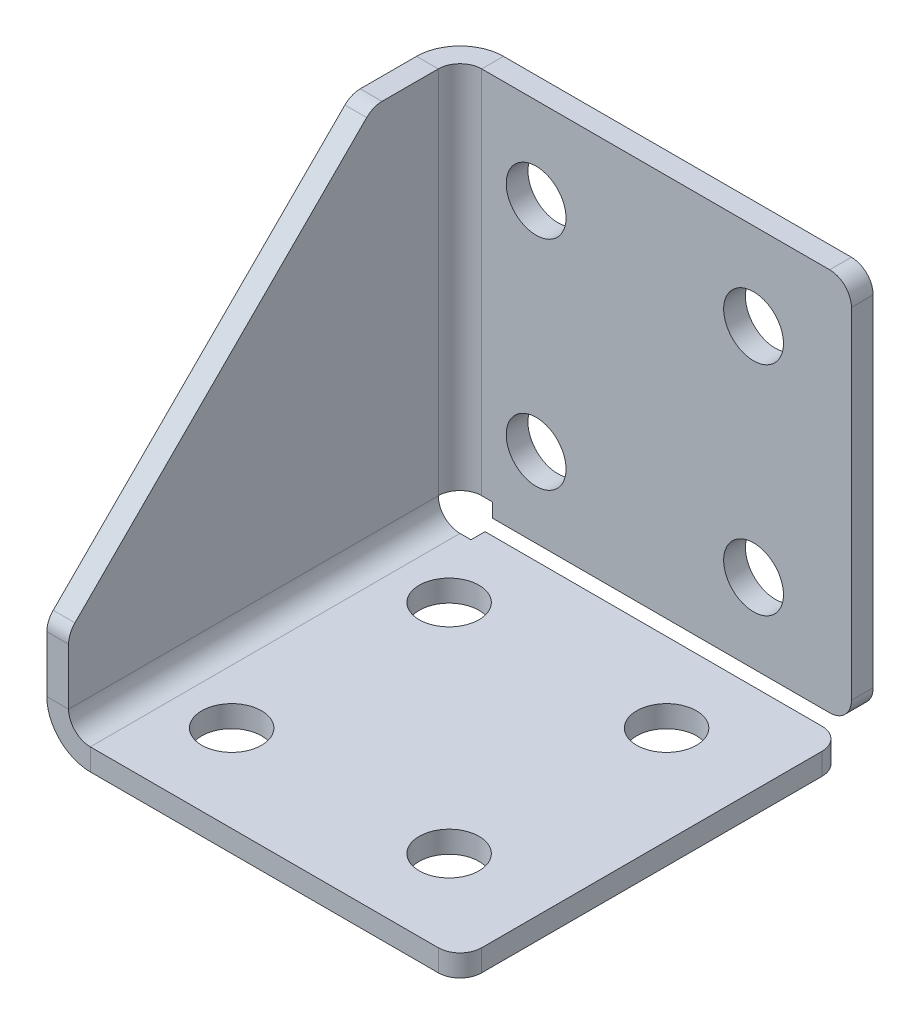
ISO-10303-21;
HEADER;
FILE_DESCRIPTION(('STEP AP214'),'2;1');
FILE_NAME('part.step','',(''),(''),'','','');
FILE_SCHEMA(('AUTOMOTIVE_DESIGN { 1 0 10303 214 1 1 1 1 }'));
ENDSEC;
DATA;
#1=APPLICATION_CONTEXT('core data for automotive mechanical design processes');
#2=APPLICATION_PROTOCOL_DEFINITION('international standard','automotive_design',2000,#1);
#3=PRODUCT_CONTEXT('',#1,'mechanical');
#4=PRODUCT('Part','Part','',(#3));
#5=PRODUCT_RELATED_PRODUCT_CATEGORY('part','',(#4));
#6=PRODUCT_DEFINITION_FORMATION('','',#4);
#7=PRODUCT_DEFINITION_CONTEXT('part definition',#1,'design');
#8=PRODUCT_DEFINITION('design','',#6,#7);
#9=PRODUCT_DEFINITION_SHAPE('','',#8);
#10=(LENGTH_UNIT() NAMED_UNIT(*) SI_UNIT(.MILLI.,.METRE.));
#11=(NAMED_UNIT(*) PLANE_ANGLE_UNIT() SI_UNIT($,.RADIAN.));
#12=(NAMED_UNIT(*) SI_UNIT($,.STERADIAN.) SOLID_ANGLE_UNIT());
#13=UNCERTAINTY_MEASURE_WITH_UNIT(LENGTH_MEASURE(1.E-05),#10,'distance_accuracy_value','');
#14=(GEOMETRIC_REPRESENTATION_CONTEXT(3) GLOBAL_UNCERTAINTY_ASSIGNED_CONTEXT((#13)) GLOBAL_UNIT_ASSIGNED_CONTEXT((#10,
#11,#12)) REPRESENTATION_CONTEXT('',''));
#15=CARTESIAN_POINT('',(0.,0.,0.));
#16=DIRECTION('',(0.,0.,1.));
#17=DIRECTION('',(1.,0.,0.));
#18=AXIS2_PLACEMENT_3D('',#15,#16,#17);
#19=CARTESIAN_POINT('',(-19.,2.,38.));
#20=DIRECTION('',(0.,-1.,0.));
#21=DIRECTION('',(0.,0.,-1.));
#22=AXIS2_PLACEMENT_3D('',#19,#20,#21);
#23=PLANE('',#22);
#24=CARTESIAN_POINT('',(-10.,2.,10.));
#25=DIRECTION('',(0.,1.,0.));
#26=DIRECTION('',(0.,0.,1.));
#27=AXIS2_PLACEMENT_3D('',#24,#25,#26);
#28=CIRCLE('',#27,2.74999999999999);
#29=CARTESIAN_POINT('',(-10.,2.,12.75));
#30=VERTEX_POINT('',#29);
#31=EDGE_CURVE('E645',#30,#30,#28,.T.);
#32=ORIENTED_EDGE('',*,*,#31,.F.);
#33=EDGE_LOOP('',(#32));
#34=FACE_BOUND('',#33,.T.);
#35=CARTESIAN_POINT('',(10.,2.,30.));
#36=DIRECTION('',(0.,1.,0.));
#37=DIRECTION('',(0.,0.,1.));
#38=AXIS2_PLACEMENT_3D('',#35,#36,#37);
#39=CIRCLE('',#38,2.74999999999999);
#40=CARTESIAN_POINT('',(10.,2.,32.75));
#41=VERTEX_POINT('',#40);
#42=EDGE_CURVE('E637',#41,#41,#39,.T.);
#43=ORIENTED_EDGE('',*,*,#42,.F.);
#44=EDGE_LOOP('',(#43));
#45=FACE_BOUND('',#44,.T.);
#46=CARTESIAN_POINT('',(10.,2.,10.));
#47=DIRECTION('',(0.,1.,0.));
#48=DIRECTION('',(0.,0.,1.));
#49=AXIS2_PLACEMENT_3D('',#46,#47,#48);
#50=CIRCLE('',#49,2.74999999999999);
#51=CARTESIAN_POINT('',(10.,2.,12.75));
#52=VERTEX_POINT('',#51);
#53=EDGE_CURVE('E621',#52,#52,#50,.T.);
#54=ORIENTED_EDGE('',*,*,#53,.F.);
#55=EDGE_LOOP('',(#54));
#56=FACE_BOUND('',#55,.T.);
#57=DIRECTION('',(0.,0.,-1.));
#58=VECTOR('',#57,1.);
#59=CARTESIAN_POINT('',(19.,2.,38.));
#60=LINE('',#59,#58);
#61=CARTESIAN_POINT('',(19.,2.,36.));
#62=VERTEX_POINT('',#61);
#63=CARTESIAN_POINT('',(19.,2.,4.70710678118655));
#64=VERTEX_POINT('',#63);
#65=EDGE_CURVE('E349',#62,#64,#60,.T.);
#66=ORIENTED_EDGE('',*,*,#65,.T.);
#67=CARTESIAN_POINT('',(17.,2.,4.70710678118655));
#68=DIRECTION('',(0.,-1.,0.));
#69=DIRECTION('',(0.,0.,-1.));
#70=AXIS2_PLACEMENT_3D('',#67,#68,#69);
#71=CIRCLE('',#70,2.);
#72=CARTESIAN_POINT('',(17.,2.,2.70710678118655));
#73=VERTEX_POINT('',#72);
#74=EDGE_CURVE('E440',#64,#73,#71,.F.);
#75=ORIENTED_EDGE('',*,*,#74,.T.);
#76=DIRECTION('',(1.,0.,0.));
#77=VECTOR('',#76,1.);
#78=CARTESIAN_POINT('',(-19.,2.,2.70710678118655));
#79=LINE('',#78,#77);
#80=CARTESIAN_POINT('',(-13.989599,2.,2.70710678118655));
#81=VERTEX_POINT('',#80);
#82=EDGE_CURVE('E317',#81,#73,#79,.T.);
#83=ORIENTED_EDGE('',*,*,#82,.F.);
#84=DIRECTION('',(0.,0.,-1.));
#85=VECTOR('',#84,1.);
#86=CARTESIAN_POINT('',(-13.989599,2.,38.));
#87=LINE('',#86,#85);
#88=CARTESIAN_POINT('',(-13.989599,2.,3.99999999999997));
#89=VERTEX_POINT('',#88);
#90=EDGE_CURVE('E209',#89,#81,#87,.T.);
#91=ORIENTED_EDGE('',*,*,#90,.F.);
#92=DIRECTION('',(1.,0.,0.));
#93=VECTOR('',#92,1.);
#94=CARTESIAN_POINT('',(-19.,2.,3.99999999999997));
#95=LINE('',#94,#93);
#96=CARTESIAN_POINT('',(-15.,2.,3.99999999999997));
#97=VERTEX_POINT('',#96);
#98=EDGE_CURVE('E313',#89,#97,#95,.F.);
#99=ORIENTED_EDGE('',*,*,#98,.T.);
#100=DIRECTION('',(0.,0.,-1.));
#101=VECTOR('',#100,1.);
#102=CARTESIAN_POINT('',(-15.,2.,38.));
#103=LINE('',#102,#101);
#104=CARTESIAN_POINT('',(-15.,2.,38.));
#105=VERTEX_POINT('',#104);
#106=EDGE_CURVE('E299',#105,#97,#103,.T.);
#107=ORIENTED_EDGE('',*,*,#106,.F.);
#108=DIRECTION('',(1.,0.,0.));
#109=VECTOR('',#108,1.);
#110=CARTESIAN_POINT('',(-19.,2.,38.));
#111=LINE('',#110,#109);
#112=CARTESIAN_POINT('',(17.,2.,38.));
#113=VERTEX_POINT('',#112);
#114=EDGE_CURVE('E341',#105,#113,#111,.T.);
#115=ORIENTED_EDGE('',*,*,#114,.T.);
#116=CARTESIAN_POINT('',(17.,2.,36.));
#117=DIRECTION('',(0.,-1.,0.));
#118=DIRECTION('',(0.,0.,-1.));
#119=AXIS2_PLACEMENT_3D('',#116,#117,#118);
#120=CIRCLE('',#119,2.);
#121=EDGE_CURVE('E437',#113,#62,#120,.F.);
#122=ORIENTED_EDGE('',*,*,#121,.T.);
#123=EDGE_LOOP('',(#66,#75,#83,#91,#99,#107,#115,#122));
#124=FACE_BOUND('',#123,.T.);
#125=CARTESIAN_POINT('',(-10.,2.,30.));
#126=DIRECTION('',(0.,1.,0.));
#127=DIRECTION('',(0.,0.,1.));
#128=AXIS2_PLACEMENT_3D('',#125,#126,#127);
#129=CIRCLE('',#128,2.74999999999999);
#130=CARTESIAN_POINT('',(-10.,2.,32.75));
#131=VERTEX_POINT('',#130);
#132=EDGE_CURVE('E629',#131,#131,#129,.T.);
#133=ORIENTED_EDGE('',*,*,#132,.F.);
#134=EDGE_LOOP('',(#133));
#135=FACE_BOUND('',#134,.T.);
#136=ADVANCED_FACE('F46',(#34,#45,#56,#124,#135),#23,.F.);
#137=CARTESIAN_POINT('',(-19.,0.,2.));
#138=DIRECTION('',(0.,0.,-1.));
#139=DIRECTION('',(-1.,0.,0.));
#140=AXIS2_PLACEMENT_3D('',#137,#138,#139);
#141=PLANE('',#140);
#142=CARTESIAN_POINT('',(-10.,10.,2.));
#143=DIRECTION('',(0.,0.,1.));
#144=DIRECTION('',(1.,0.,0.));
#145=AXIS2_PLACEMENT_3D('',#142,#143,#144);
#146=CIRCLE('',#145,2.75);
#147=CARTESIAN_POINT('',(-7.25,10.,2.));
#148=VERTEX_POINT('',#147);
#149=EDGE_CURVE('E613',#148,#148,#146,.T.);
#150=ORIENTED_EDGE('',*,*,#149,.F.);
#151=EDGE_LOOP('',(#150));
#152=FACE_BOUND('',#151,.T.);
#153=CARTESIAN_POINT('',(10.,30.,2.));
#154=DIRECTION('',(0.,0.,1.));
#155=DIRECTION('',(1.,0.,0.));
#156=AXIS2_PLACEMENT_3D('',#153,#154,#155);
#157=CIRCLE('',#156,2.75);
#158=CARTESIAN_POINT('',(12.75,30.,2.));
#159=VERTEX_POINT('',#158);
#160=EDGE_CURVE('E605',#159,#159,#157,.T.);
#161=ORIENTED_EDGE('',*,*,#160,.F.);
#162=EDGE_LOOP('',(#161));
#163=FACE_BOUND('',#162,.T.);
#164=CARTESIAN_POINT('',(10.,10.,2.));
#165=DIRECTION('',(0.,0.,1.));
#166=DIRECTION('',(1.,0.,0.));
#167=AXIS2_PLACEMENT_3D('',#164,#165,#166);
#168=CIRCLE('',#167,2.75);
#169=CARTESIAN_POINT('',(12.75,10.,2.));
#170=VERTEX_POINT('',#169);
#171=EDGE_CURVE('E589',#170,#170,#168,.T.);
#172=ORIENTED_EDGE('',*,*,#171,.F.);
#173=EDGE_LOOP('',(#172));
#174=FACE_BOUND('',#173,.T.);
#175=DIRECTION('',(0.,1.,0.));
#176=VECTOR('',#175,1.);
#177=CARTESIAN_POINT('',(19.,0.,2.));
#178=LINE('',#177,#176);
#179=CARTESIAN_POINT('',(19.,4.70710678118655,2.));
#180=VERTEX_POINT('',#179);
#181=CARTESIAN_POINT('',(19.,36.,2.));
#182=VERTEX_POINT('',#181);
#183=EDGE_CURVE('E318',#180,#182,#178,.T.);
#184=ORIENTED_EDGE('',*,*,#183,.T.);
#185=CARTESIAN_POINT('',(17.,36.,2.));
#186=DIRECTION('',(0.,0.,-1.));
#187=DIRECTION('',(-1.,0.,0.));
#188=AXIS2_PLACEMENT_3D('',#185,#186,#187);
#189=CIRCLE('',#188,2.);
#190=CARTESIAN_POINT('',(17.,38.,2.));
#191=VERTEX_POINT('',#190);
#192=EDGE_CURVE('E416',#182,#191,#189,.F.);
#193=ORIENTED_EDGE('',*,*,#192,.T.);
#194=DIRECTION('',(-1.,0.,0.));
#195=VECTOR('',#194,1.);
#196=CARTESIAN_POINT('',(-19.,38.,2.));
#197=LINE('',#196,#195);
#198=CARTESIAN_POINT('',(-15.,38.,2.));
#199=VERTEX_POINT('',#198);
#200=EDGE_CURVE('E322',#199,#191,#197,.F.);
#201=ORIENTED_EDGE('',*,*,#200,.F.);
#202=DIRECTION('',(0.,1.,0.));
#203=VECTOR('',#202,1.);
#204=CARTESIAN_POINT('',(-15.,0.,2.));
#205=LINE('',#204,#203);
#206=CARTESIAN_POINT('',(-15.,3.99999999999997,2.));
#207=VERTEX_POINT('',#206);
#208=EDGE_CURVE('E290',#207,#199,#205,.T.);
#209=ORIENTED_EDGE('',*,*,#208,.F.);
#210=DIRECTION('',(-1.,0.,0.));
#211=VECTOR('',#210,1.);
#212=CARTESIAN_POINT('',(-19.,3.99999999999997,2.));
#213=LINE('',#212,#211);
#214=CARTESIAN_POINT('',(-13.989599,3.99999999999997,2.));
#215=VERTEX_POINT('',#214);
#216=EDGE_CURVE('E295',#207,#215,#213,.F.);
#217=ORIENTED_EDGE('',*,*,#216,.T.);
#218=DIRECTION('',(0.,1.,0.));
#219=VECTOR('',#218,1.);
#220=CARTESIAN_POINT('',(-13.989599,0.,2.));
#221=LINE('',#220,#219);
#222=CARTESIAN_POINT('',(-13.989599,2.70710678118655,2.));
#223=VERTEX_POINT('',#222);
#224=EDGE_CURVE('E309',#223,#215,#221,.T.);
#225=ORIENTED_EDGE('',*,*,#224,.F.);
#226=DIRECTION('',(-1.,0.,0.));
#227=VECTOR('',#226,1.);
#228=CARTESIAN_POINT('',(-19.,2.70710678118655,2.));
#229=LINE('',#228,#227);
#230=CARTESIAN_POINT('',(17.,2.70710678118655,2.));
#231=VERTEX_POINT('',#230);
#232=EDGE_CURVE('E314',#231,#223,#229,.T.);
#233=ORIENTED_EDGE('',*,*,#232,.F.);
#234=CARTESIAN_POINT('',(17.,4.70710678118655,2.));
#235=DIRECTION('',(0.,0.,-1.));
#236=DIRECTION('',(-1.,0.,0.));
#237=AXIS2_PLACEMENT_3D('',#234,#235,#236);
#238=CIRCLE('',#237,2.);
#239=EDGE_CURVE('E413',#231,#180,#238,.F.);
#240=ORIENTED_EDGE('',*,*,#239,.T.);
#241=EDGE_LOOP('',(#184,#193,#201,#209,#217,#225,#233,#240));
#242=FACE_BOUND('',#241,.T.);
#243=CARTESIAN_POINT('',(-10.,30.,2.));
#244=DIRECTION('',(0.,0.,1.));
#245=DIRECTION('',(1.,0.,0.));
#246=AXIS2_PLACEMENT_3D('',#243,#244,#245);
#247=CIRCLE('',#246,2.75);
#248=CARTESIAN_POINT('',(-7.25,30.,2.));
#249=VERTEX_POINT('',#248);
#250=EDGE_CURVE('E597',#249,#249,#247,.T.);
#251=ORIENTED_EDGE('',*,*,#250,.F.);
#252=EDGE_LOOP('',(#251));
#253=FACE_BOUND('',#252,.T.);
#254=ADVANCED_FACE('F520',(#152,#163,#174,#242,#253),#141,.F.);
#255=CARTESIAN_POINT('',(-15.,4.,3.99999999999997));
#256=DIRECTION('',(0.,0.,-1.));
#257=DIRECTION('',(-1.,0.,0.));
#258=AXIS2_PLACEMENT_3D('',#255,#256,#257);
#259=PLANE('',#258);
#260=DIRECTION('',(-1.,0.,0.));
#261=VECTOR('',#260,1.);
#262=CARTESIAN_POINT('',(-19.,3.99999999999997,3.99999999999997));
#263=LINE('',#262,#261);
#264=CARTESIAN_POINT('',(-17.,3.99999999999997,3.99999999999999));
#265=VERTEX_POINT('',#264);
#266=CARTESIAN_POINT('',(-19.,3.99999999999997,3.99999999999997));
#267=VERTEX_POINT('',#266);
#268=EDGE_CURVE('E391',#265,#267,#263,.T.);
#269=ORIENTED_EDGE('',*,*,#268,.F.);
#270=CARTESIAN_POINT('',(-15.,4.,3.99999999999997));
#271=DIRECTION('',(0.,0.,1.));
#272=DIRECTION('',(1.,0.,0.));
#273=AXIS2_PLACEMENT_3D('',#270,#271,#272);
#274=CIRCLE('',#273,2.);
#275=EDGE_CURVE('E345',#265,#97,#274,.T.);
#276=ORIENTED_EDGE('',*,*,#275,.T.);
#277=DIRECTION('',(0.,-1.,0.));
#278=VECTOR('',#277,1.);
#279=CARTESIAN_POINT('',(-15.,0.,3.99999999999997));
#280=LINE('',#279,#278);
#281=CARTESIAN_POINT('',(-15.,0.,3.99999999999997));
#282=VERTEX_POINT('',#281);
#283=EDGE_CURVE('E388',#97,#282,#280,.T.);
#284=ORIENTED_EDGE('',*,*,#283,.T.);
#285=CARTESIAN_POINT('',(-15.,4.,3.99999999999997));
#286=DIRECTION('',(0.,0.,1.));
#287=DIRECTION('',(1.,0.,0.));
#288=AXIS2_PLACEMENT_3D('',#285,#286,#287);
#289=CIRCLE('',#288,4.);
#290=EDGE_CURVE('E282',#267,#282,#289,.T.);
#291=ORIENTED_EDGE('',*,*,#290,.F.);
#292=EDGE_LOOP('',(#269,#276,#284,#291));
#293=FACE_BOUND('',#292,.T.);
#294=ADVANCED_FACE('F547',(#293),#259,.T.);
#295=CARTESIAN_POINT('',(-19.,0.,3.99999999999997));
#296=DIRECTION('',(0.,0.,1.));
#297=DIRECTION('',(-1.,0.,0.));
#298=AXIS2_PLACEMENT_3D('',#295,#296,#297);
#299=PLANE('',#298);
#300=ORIENTED_EDGE('',*,*,#283,.F.);
#301=ORIENTED_EDGE('',*,*,#98,.F.);
#302=DIRECTION('',(0.,-1.,0.));
#303=VECTOR('',#302,1.);
#304=CARTESIAN_POINT('',(-13.989599,0.,3.99999999999997));
#305=LINE('',#304,#303);
#306=CARTESIAN_POINT('',(-13.989599,0.,3.99999999999997));
#307=VERTEX_POINT('',#306);
#308=EDGE_CURVE('E215',#89,#307,#305,.T.);
#309=ORIENTED_EDGE('',*,*,#308,.T.);
#310=DIRECTION('',(-1.,0.,0.));
#311=VECTOR('',#310,1.);
#312=CARTESIAN_POINT('',(-19.,0.,3.99999999999997));
#313=LINE('',#312,#311);
#314=EDGE_CURVE('E225',#307,#282,#313,.T.);
#315=ORIENTED_EDGE('',*,*,#314,.T.);
#316=EDGE_LOOP('',(#300,#301,#309,#315));
#317=FACE_BOUND('',#316,.T.);
#318=ADVANCED_FACE('F732',(#317),#299,.F.);
#319=CARTESIAN_POINT('',(-13.989599,0.,38.));
#320=DIRECTION('',(-1.,0.,0.));
#321=DIRECTION('',(0.,0.,-1.));
#322=AXIS2_PLACEMENT_3D('',#319,#320,#321);
#323=PLANE('',#322);
#324=ORIENTED_EDGE('',*,*,#308,.F.);
#325=ORIENTED_EDGE('',*,*,#90,.T.);
#326=DIRECTION('',(0.,-1.,0.));
#327=VECTOR('',#326,1.);
#328=CARTESIAN_POINT('',(-13.989599,0.,2.70710678118655));
#329=LINE('',#328,#327);
#330=CARTESIAN_POINT('',(-13.989599,0.,2.70710678118655));
#331=VERTEX_POINT('',#330);
#332=EDGE_CURVE('E204',#81,#331,#329,.T.);
#333=ORIENTED_EDGE('',*,*,#332,.T.);
#334=DIRECTION('',(0.,0.,-1.));
#335=VECTOR('',#334,1.);
#336=CARTESIAN_POINT('',(-13.989599,0.,38.));
#337=LINE('',#336,#335);
#338=EDGE_CURVE('E207',#307,#331,#337,.T.);
#339=ORIENTED_EDGE('',*,*,#338,.F.);
#340=EDGE_LOOP('',(#324,#325,#333,#339));
#341=FACE_BOUND('',#340,.T.);
#342=ADVANCED_FACE('F206',(#341),#323,.T.);
#343=CARTESIAN_POINT('',(-19.,0.,2.70710678118655));
#344=DIRECTION('',(0.,0.,-1.));
#345=DIRECTION('',(1.,0.,0.));
#346=AXIS2_PLACEMENT_3D('',#343,#344,#345);
#347=PLANE('',#346);
#348=ORIENTED_EDGE('',*,*,#82,.T.);
#349=DIRECTION('',(0.,1.,0.));
#350=VECTOR('',#349,1.);
#351=CARTESIAN_POINT('',(17.,0.,2.70710678118655));
#352=LINE('',#351,#350);
#353=CARTESIAN_POINT('',(17.,0.,2.70710678118655));
#354=VERTEX_POINT('',#353);
#355=EDGE_CURVE('E232',#73,#354,#352,.F.);
#356=ORIENTED_EDGE('',*,*,#355,.T.);
#357=DIRECTION('',(1.,0.,0.));
#358=VECTOR('',#357,1.);
#359=CARTESIAN_POINT('',(-19.,0.,2.70710678118655));
#360=LINE('',#359,#358);
#361=EDGE_CURVE('E222',#331,#354,#360,.T.);
#362=ORIENTED_EDGE('',*,*,#361,.F.);
#363=ORIENTED_EDGE('',*,*,#332,.F.);
#364=EDGE_LOOP('',(#348,#356,#362,#363));
#365=FACE_BOUND('',#364,.T.);
#366=ADVANCED_FACE('F230',(#365),#347,.T.);
#367=CARTESIAN_POINT('',(19.,0.,38.));
#368=DIRECTION('',(-1.,0.,0.));
#369=DIRECTION('',(0.,0.,-1.));
#370=AXIS2_PLACEMENT_3D('',#367,#368,#369);
#371=PLANE('',#370);
#372=DIRECTION('',(0.,0.,-1.));
#373=VECTOR('',#372,1.);
#374=CARTESIAN_POINT('',(19.,0.,38.));
#375=LINE('',#374,#373);
#376=CARTESIAN_POINT('',(19.,0.,36.));
#377=VERTEX_POINT('',#376);
#378=CARTESIAN_POINT('',(19.,0.,4.70710678118655));
#379=VERTEX_POINT('',#378);
#380=EDGE_CURVE('E274',#377,#379,#375,.T.);
#381=ORIENTED_EDGE('',*,*,#380,.T.);
#382=DIRECTION('',(0.,-1.,0.));
#383=VECTOR('',#382,1.);
#384=CARTESIAN_POINT('',(19.,0.,4.70710678118655));
#385=LINE('',#384,#383);
#386=EDGE_CURVE('E434',#379,#64,#385,.F.);
#387=ORIENTED_EDGE('',*,*,#386,.T.);
#388=ORIENTED_EDGE('',*,*,#65,.F.);
#389=DIRECTION('',(0.,1.,0.));
#390=VECTOR('',#389,1.);
#391=CARTESIAN_POINT('',(19.,0.,36.));
#392=LINE('',#391,#390);
#393=EDGE_CURVE('E430',#62,#377,#392,.F.);
#394=ORIENTED_EDGE('',*,*,#393,.T.);
#395=EDGE_LOOP('',(#381,#387,#388,#394));
#396=FACE_BOUND('',#395,.T.);
#397=ADVANCED_FACE('F578',(#396),#371,.F.);
#398=CARTESIAN_POINT('',(-19.,0.,38.));
#399=DIRECTION('',(0.,0.,-1.));
#400=DIRECTION('',(1.,0.,0.));
#401=AXIS2_PLACEMENT_3D('',#398,#399,#400);
#402=PLANE('',#401);
#403=DIRECTION('',(1.,0.,0.));
#404=VECTOR('',#403,1.);
#405=CARTESIAN_POINT('',(-19.,0.,38.));
#406=LINE('',#405,#404);
#407=CARTESIAN_POINT('',(-15.,0.,38.));
#408=VERTEX_POINT('',#407);
#409=CARTESIAN_POINT('',(17.,0.,38.));
#410=VERTEX_POINT('',#409);
#411=EDGE_CURVE('E494',#408,#410,#406,.T.);
#412=ORIENTED_EDGE('',*,*,#411,.T.);
#413=DIRECTION('',(0.,1.,0.));
#414=VECTOR('',#413,1.);
#415=CARTESIAN_POINT('',(17.,0.,38.));
#416=LINE('',#415,#414);
#417=EDGE_CURVE('E443',#410,#113,#416,.T.);
#418=ORIENTED_EDGE('',*,*,#417,.T.);
#419=ORIENTED_EDGE('',*,*,#114,.F.);
#420=DIRECTION('',(0.,-1.,0.));
#421=VECTOR('',#420,1.);
#422=CARTESIAN_POINT('',(-15.,0.,38.));
#423=LINE('',#422,#421);
#424=EDGE_CURVE('E216',#105,#408,#423,.T.);
#425=ORIENTED_EDGE('',*,*,#424,.T.);
#426=EDGE_LOOP('',(#412,#418,#419,#425));
#427=FACE_BOUND('',#426,.T.);
#428=ADVANCED_FACE('F565',(#427),#402,.F.);
#429=CARTESIAN_POINT('',(-15.,4.,38.));
#430=DIRECTION('',(0.,0.,-1.));
#431=DIRECTION('',(-1.,0.,0.));
#432=AXIS2_PLACEMENT_3D('',#429,#430,#431);
#433=PLANE('',#432);
#434=ORIENTED_EDGE('',*,*,#424,.F.);
#435=CARTESIAN_POINT('',(-15.,4.,38.));
#436=DIRECTION('',(0.,0.,1.));
#437=DIRECTION('',(1.,0.,0.));
#438=AXIS2_PLACEMENT_3D('',#435,#436,#437);
#439=CIRCLE('',#438,2.);
#440=CARTESIAN_POINT('',(-17.,4.,38.));
#441=VERTEX_POINT('',#440);
#442=EDGE_CURVE('E332',#105,#441,#439,.F.);
#443=ORIENTED_EDGE('',*,*,#442,.T.);
#444=DIRECTION('',(-1.,0.,0.));
#445=VECTOR('',#444,1.);
#446=CARTESIAN_POINT('',(-19.,4.,38.));
#447=LINE('',#446,#445);
#448=CARTESIAN_POINT('',(-19.,4.,38.));
#449=VERTEX_POINT('',#448);
#450=EDGE_CURVE('E380',#441,#449,#447,.T.);
#451=ORIENTED_EDGE('',*,*,#450,.T.);
#452=CARTESIAN_POINT('',(-15.,4.,38.));
#453=DIRECTION('',(0.,0.,1.));
#454=DIRECTION('',(1.,0.,0.));
#455=AXIS2_PLACEMENT_3D('',#452,#453,#454);
#456=CIRCLE('',#455,4.);
#457=EDGE_CURVE('E270',#408,#449,#456,.F.);
#458=ORIENTED_EDGE('',*,*,#457,.F.);
#459=EDGE_LOOP('',(#434,#443,#451,#458));
#460=FACE_BOUND('',#459,.T.);
#461=ADVANCED_FACE('F556',(#460),#433,.F.);
#462=CARTESIAN_POINT('',(-19.,10.,38.));
#463=DIRECTION('',(0.,0.,1.));
#464=DIRECTION('',(0.,-1.,0.));
#465=AXIS2_PLACEMENT_3D('',#462,#463,#464);
#466=PLANE('',#465);
#467=DIRECTION('',(0.,1.,0.));
#468=VECTOR('',#467,1.);
#469=CARTESIAN_POINT('',(-17.,0.,38.));
#470=LINE('',#469,#468);
#471=CARTESIAN_POINT('',(-17.,9.17157287525381,38.));
#472=VERTEX_POINT('',#471);
#473=EDGE_CURVE('E338',#472,#441,#470,.F.);
#474=ORIENTED_EDGE('',*,*,#473,.F.);
#475=DIRECTION('',(-1.,0.,0.));
#476=VECTOR('',#475,1.);
#477=CARTESIAN_POINT('',(-19.,9.17157287525381,38.));
#478=LINE('',#477,#476);
#479=CARTESIAN_POINT('',(-19.,9.17157287525381,38.));
#480=VERTEX_POINT('',#479);
#481=EDGE_CURVE('E446',#472,#480,#478,.T.);
#482=ORIENTED_EDGE('',*,*,#481,.T.);
#483=DIRECTION('',(0.,-1.,0.));
#484=VECTOR('',#483,1.);
#485=CARTESIAN_POINT('',(-19.,10.,38.));
#486=LINE('',#485,#484);
#487=EDGE_CURVE('E483',#480,#449,#486,.T.);
#488=ORIENTED_EDGE('',*,*,#487,.T.);
#489=ORIENTED_EDGE('',*,*,#450,.F.);
#490=EDGE_LOOP('',(#474,#482,#488,#489));
#491=FACE_BOUND('',#490,.T.);
#492=ADVANCED_FACE('F476',(#491),#466,.T.);
#493=CARTESIAN_POINT('',(-19.,38.,10.));
#494=DIRECTION('',(0.,0.707106781186548,0.707106781186548));
#495=DIRECTION('',(0.,-0.707106781186547,0.707106781186547));
#496=AXIS2_PLACEMENT_3D('',#493,#494,#495);
#497=PLANE('',#496);
#498=DIRECTION('',(0.,-0.707106781186547,0.707106781186547));
#499=VECTOR('',#498,1.);
#500=CARTESIAN_POINT('',(-19.,38.,10.));
#501=LINE('',#500,#499);
#502=CARTESIAN_POINT('',(-19.,37.4142135623731,10.5857864376269));
#503=VERTEX_POINT('',#502);
#504=CARTESIAN_POINT('',(-19.,10.5857864376269,37.4142135623731));
#505=VERTEX_POINT('',#504);
#506=EDGE_CURVE('E482',#503,#505,#501,.T.);
#507=ORIENTED_EDGE('',*,*,#506,.T.);
#508=DIRECTION('',(-1.,0.,0.));
#509=VECTOR('',#508,1.);
#510=CARTESIAN_POINT('',(-19.,10.5857864376269,37.4142135623731));
#511=LINE('',#510,#509);
#512=CARTESIAN_POINT('',(-17.,10.5857864376269,37.4142135623731));
#513=VERTEX_POINT('',#512);
#514=EDGE_CURVE('E68',#505,#513,#511,.F.);
#515=ORIENTED_EDGE('',*,*,#514,.T.);
#516=DIRECTION('',(0.,-0.707106781186547,0.707106781186547));
#517=VECTOR('',#516,1.);
#518=CARTESIAN_POINT('',(-17.,38.,10.));
#519=LINE('',#518,#517);
#520=CARTESIAN_POINT('',(-17.,37.4142135623731,10.5857864376269));
#521=VERTEX_POINT('',#520);
#522=EDGE_CURVE('E335',#521,#513,#519,.T.);
#523=ORIENTED_EDGE('',*,*,#522,.F.);
#524=DIRECTION('',(-1.,0.,0.));
#525=VECTOR('',#524,1.);
#526=CARTESIAN_POINT('',(-19.,37.4142135623731,10.5857864376269));
#527=LINE('',#526,#525);
#528=EDGE_CURVE('E456',#521,#503,#527,.T.);
#529=ORIENTED_EDGE('',*,*,#528,.T.);
#530=EDGE_LOOP('',(#507,#515,#523,#529));
#531=FACE_BOUND('',#530,.T.);
#532=ADVANCED_FACE('F484',(#531),#497,.T.);
#533=CARTESIAN_POINT('',(-19.,38.,0.));
#534=DIRECTION('',(0.,1.,0.));
#535=DIRECTION('',(0.,0.,1.));
#536=AXIS2_PLACEMENT_3D('',#533,#534,#535);
#537=PLANE('',#536);
#538=DIRECTION('',(0.,0.,1.));
#539=VECTOR('',#538,1.);
#540=CARTESIAN_POINT('',(-19.,38.,0.));
#541=LINE('',#540,#539);
#542=CARTESIAN_POINT('',(-19.,38.,4.));
#543=VERTEX_POINT('',#542);
#544=CARTESIAN_POINT('',(-19.,38.,9.17157287525381));
#545=VERTEX_POINT('',#544);
#546=EDGE_CURVE('E487',#543,#545,#541,.T.);
#547=ORIENTED_EDGE('',*,*,#546,.T.);
#548=DIRECTION('',(-1.,0.,0.));
#549=VECTOR('',#548,1.);
#550=CARTESIAN_POINT('',(-19.,38.,9.17157287525381));
#551=LINE('',#550,#549);
#552=CARTESIAN_POINT('',(-17.,38.,9.17157287525381));
#553=VERTEX_POINT('',#552);
#554=EDGE_CURVE('E11',#545,#553,#551,.F.);
#555=ORIENTED_EDGE('',*,*,#554,.T.);
#556=DIRECTION('',(0.,0.,-1.));
#557=VECTOR('',#556,1.);
#558=CARTESIAN_POINT('',(-17.,38.,0.));
#559=LINE('',#558,#557);
#560=CARTESIAN_POINT('',(-17.,38.,4.));
#561=VERTEX_POINT('',#560);
#562=EDGE_CURVE('E326',#561,#553,#559,.F.);
#563=ORIENTED_EDGE('',*,*,#562,.F.);
#564=DIRECTION('',(-1.,0.,0.));
#565=VECTOR('',#564,1.);
#566=CARTESIAN_POINT('',(-19.,38.,4.));
#567=LINE('',#566,#565);
#568=EDGE_CURVE('E377',#561,#543,#567,.T.);
#569=ORIENTED_EDGE('',*,*,#568,.T.);
#570=EDGE_LOOP('',(#547,#555,#563,#569));
#571=FACE_BOUND('',#570,.T.);
#572=ADVANCED_FACE('F714',(#571),#537,.T.);
#573=CARTESIAN_POINT('',(-15.,38.,4.));
#574=DIRECTION('',(0.,1.,0.));
#575=DIRECTION('',(0.,0.,1.));
#576=AXIS2_PLACEMENT_3D('',#573,#574,#575);
#577=PLANE('',#576);
#578=ORIENTED_EDGE('',*,*,#568,.F.);
#579=CARTESIAN_POINT('',(-15.,38.,4.));
#580=DIRECTION('',(0.,-1.,0.));
#581=DIRECTION('',(0.,0.,-1.));
#582=AXIS2_PLACEMENT_3D('',#579,#580,#581);
#583=CIRCLE('',#582,2.);
#584=EDGE_CURVE('E327',#561,#199,#583,.T.);
#585=ORIENTED_EDGE('',*,*,#584,.T.);
#586=DIRECTION('',(0.,0.,-1.));
#587=VECTOR('',#586,1.);
#588=CARTESIAN_POINT('',(-15.,38.,0.));
#589=LINE('',#588,#587);
#590=CARTESIAN_POINT('',(-15.,38.,0.));
#591=VERTEX_POINT('',#590);
#592=EDGE_CURVE('E374',#199,#591,#589,.T.);
#593=ORIENTED_EDGE('',*,*,#592,.T.);
#594=CARTESIAN_POINT('',(-15.,38.,4.));
#595=DIRECTION('',(0.,-1.,0.));
#596=DIRECTION('',(0.,0.,-1.));
#597=AXIS2_PLACEMENT_3D('',#594,#595,#596);
#598=CIRCLE('',#597,4.);
#599=EDGE_CURVE('E265',#543,#591,#598,.T.);
#600=ORIENTED_EDGE('',*,*,#599,.F.);
#601=EDGE_LOOP('',(#578,#585,#593,#600));
#602=FACE_BOUND('',#601,.T.);
#603=ADVANCED_FACE('F711',(#602),#577,.T.);
#604=CARTESIAN_POINT('',(-19.,38.,0.));
#605=DIRECTION('',(0.,1.,0.));
#606=DIRECTION('',(1.,0.,0.));
#607=AXIS2_PLACEMENT_3D('',#604,#605,#606);
#608=PLANE('',#607);
#609=ORIENTED_EDGE('',*,*,#200,.T.);
#610=DIRECTION('',(0.,0.,1.));
#611=VECTOR('',#610,1.);
#612=CARTESIAN_POINT('',(17.,38.,0.));
#613=LINE('',#612,#611);
#614=CARTESIAN_POINT('',(17.,38.,0.));
#615=VERTEX_POINT('',#614);
#616=EDGE_CURVE('E394',#191,#615,#613,.F.);
#617=ORIENTED_EDGE('',*,*,#616,.T.);
#618=DIRECTION('',(1.,0.,0.));
#619=VECTOR('',#618,1.);
#620=CARTESIAN_POINT('',(-19.,38.,0.));
#621=LINE('',#620,#619);
#622=EDGE_CURVE('E242',#591,#615,#621,.T.);
#623=ORIENTED_EDGE('',*,*,#622,.F.);
#624=ORIENTED_EDGE('',*,*,#592,.F.);
#625=EDGE_LOOP('',(#609,#617,#623,#624));
#626=FACE_BOUND('',#625,.T.);
#627=ADVANCED_FACE('F508',(#626),#608,.T.);
#628=CARTESIAN_POINT('',(19.,0.,0.));
#629=DIRECTION('',(-1.,0.,0.));
#630=DIRECTION('',(0.,1.,0.));
#631=AXIS2_PLACEMENT_3D('',#628,#629,#630);
#632=PLANE('',#631);
#633=DIRECTION('',(0.,1.,0.));
#634=VECTOR('',#633,1.);
#635=CARTESIAN_POINT('',(19.,0.,0.));
#636=LINE('',#635,#634);
#637=CARTESIAN_POINT('',(19.,4.70710678118655,0.));
#638=VERTEX_POINT('',#637);
#639=CARTESIAN_POINT('',(19.,36.,0.));
#640=VERTEX_POINT('',#639);
#641=EDGE_CURVE('E234',#638,#640,#636,.T.);
#642=ORIENTED_EDGE('',*,*,#641,.T.);
#643=DIRECTION('',(0.,0.,-1.));
#644=VECTOR('',#643,1.);
#645=CARTESIAN_POINT('',(19.,36.,0.));
#646=LINE('',#645,#644);
#647=EDGE_CURVE('E410',#640,#182,#646,.F.);
#648=ORIENTED_EDGE('',*,*,#647,.T.);
#649=ORIENTED_EDGE('',*,*,#183,.F.);
#650=DIRECTION('',(0.,0.,-1.));
#651=VECTOR('',#650,1.);
#652=CARTESIAN_POINT('',(19.,4.70710678118655,0.));
#653=LINE('',#652,#651);
#654=EDGE_CURVE('E406',#180,#638,#653,.T.);
#655=ORIENTED_EDGE('',*,*,#654,.T.);
#656=EDGE_LOOP('',(#642,#648,#649,#655));
#657=FACE_BOUND('',#656,.T.);
#658=ADVANCED_FACE('F517',(#657),#632,.F.);
#659=CARTESIAN_POINT('',(-19.,2.70710678118655,0.));
#660=DIRECTION('',(0.,-1.,0.));
#661=DIRECTION('',(-1.,0.,0.));
#662=AXIS2_PLACEMENT_3D('',#659,#660,#661);
#663=PLANE('',#662);
#664=DIRECTION('',(-1.,0.,0.));
#665=VECTOR('',#664,1.);
#666=CARTESIAN_POINT('',(-19.,2.70710678118655,0.));
#667=LINE('',#666,#665);
#668=CARTESIAN_POINT('',(17.,2.70710678118655,0.));
#669=VERTEX_POINT('',#668);
#670=CARTESIAN_POINT('',(-13.989599,2.70710678118655,0.));
#671=VERTEX_POINT('',#670);
#672=EDGE_CURVE('E227',#669,#671,#667,.T.);
#673=ORIENTED_EDGE('',*,*,#672,.F.);
#674=DIRECTION('',(0.,0.,1.));
#675=VECTOR('',#674,1.);
#676=CARTESIAN_POINT('',(17.,2.70710678118655,0.));
#677=LINE('',#676,#675);
#678=EDGE_CURVE('E419',#669,#231,#677,.T.);
#679=ORIENTED_EDGE('',*,*,#678,.T.);
#680=ORIENTED_EDGE('',*,*,#232,.T.);
#681=DIRECTION('',(0.,0.,-1.));
#682=VECTOR('',#681,1.);
#683=CARTESIAN_POINT('',(-13.989599,2.70710678118655,0.));
#684=LINE('',#683,#682);
#685=EDGE_CURVE('E370',#223,#671,#684,.T.);
#686=ORIENTED_EDGE('',*,*,#685,.T.);
#687=EDGE_LOOP('',(#673,#679,#680,#686));
#688=FACE_BOUND('',#687,.T.);
#689=ADVANCED_FACE('F530',(#688),#663,.T.);
#690=CARTESIAN_POINT('',(-13.989599,0.,0.));
#691=DIRECTION('',(-1.,0.,0.));
#692=DIRECTION('',(0.,1.,0.));
#693=AXIS2_PLACEMENT_3D('',#690,#691,#692);
#694=PLANE('',#693);
#695=ORIENTED_EDGE('',*,*,#685,.F.);
#696=ORIENTED_EDGE('',*,*,#224,.T.);
#697=DIRECTION('',(0.,0.,-1.));
#698=VECTOR('',#697,1.);
#699=CARTESIAN_POINT('',(-13.989599,3.99999999999997,0.));
#700=LINE('',#699,#698);
#701=CARTESIAN_POINT('',(-13.989599,3.99999999999997,0.));
#702=VERTEX_POINT('',#701);
#703=EDGE_CURVE('E367',#215,#702,#700,.T.);
#704=ORIENTED_EDGE('',*,*,#703,.T.);
#705=DIRECTION('',(0.,1.,0.));
#706=VECTOR('',#705,1.);
#707=CARTESIAN_POINT('',(-13.989599,0.,0.));
#708=LINE('',#707,#706);
#709=EDGE_CURVE('E248',#671,#702,#708,.T.);
#710=ORIENTED_EDGE('',*,*,#709,.F.);
#711=EDGE_LOOP('',(#695,#696,#704,#710));
#712=FACE_BOUND('',#711,.T.);
#713=ADVANCED_FACE('F534',(#712),#694,.T.);
#714=CARTESIAN_POINT('',(-19.,3.99999999999997,0.));
#715=DIRECTION('',(0.,1.,0.));
#716=DIRECTION('',(1.,0.,0.));
#717=AXIS2_PLACEMENT_3D('',#714,#715,#716);
#718=PLANE('',#717);
#719=ORIENTED_EDGE('',*,*,#703,.F.);
#720=ORIENTED_EDGE('',*,*,#216,.F.);
#721=DIRECTION('',(0.,0.,-1.));
#722=VECTOR('',#721,1.);
#723=CARTESIAN_POINT('',(-15.,3.99999999999997,0.));
#724=LINE('',#723,#722);
#725=CARTESIAN_POINT('',(-15.,3.99999999999997,0.));
#726=VERTEX_POINT('',#725);
#727=EDGE_CURVE('E281',#207,#726,#724,.T.);
#728=ORIENTED_EDGE('',*,*,#727,.T.);
#729=DIRECTION('',(1.,0.,0.));
#730=VECTOR('',#729,1.);
#731=CARTESIAN_POINT('',(-19.,3.99999999999997,0.));
#732=LINE('',#731,#730);
#733=EDGE_CURVE('E252',#726,#702,#732,.T.);
#734=ORIENTED_EDGE('',*,*,#733,.T.);
#735=EDGE_LOOP('',(#719,#720,#728,#734));
#736=FACE_BOUND('',#735,.T.);
#737=ADVANCED_FACE('F536',(#736),#718,.F.);
#738=CARTESIAN_POINT('',(-15.,3.99999999999997,4.));
#739=DIRECTION('',(0.,-1.,0.));
#740=DIRECTION('',(0.,0.,-1.));
#741=AXIS2_PLACEMENT_3D('',#738,#739,#740);
#742=PLANE('',#741);
#743=CARTESIAN_POINT('',(-15.,3.99999999999997,4.));
#744=DIRECTION('',(0.,-1.,0.));
#745=DIRECTION('',(0.,0.,-1.));
#746=AXIS2_PLACEMENT_3D('',#743,#744,#745);
#747=CIRCLE('',#746,2.);
#748=EDGE_CURVE('E331',#207,#265,#747,.F.);
#749=ORIENTED_EDGE('',*,*,#748,.T.);
#750=ORIENTED_EDGE('',*,*,#268,.T.);
#751=CARTESIAN_POINT('',(-15.,3.99999999999997,4.));
#752=DIRECTION('',(0.,1.,0.));
#753=DIRECTION('',(0.,0.,1.));
#754=AXIS2_PLACEMENT_3D('',#751,#752,#753);
#755=CIRCLE('',#754,4.);
#756=EDGE_CURVE('E269',#726,#267,#755,.T.);
#757=ORIENTED_EDGE('',*,*,#756,.F.);
#758=ORIENTED_EDGE('',*,*,#727,.F.);
#759=EDGE_LOOP('',(#749,#750,#757,#758));
#760=FACE_BOUND('',#759,.T.);
#761=ADVANCED_FACE('F541',(#760),#742,.T.);
#762=CARTESIAN_POINT('',(-19.,0.,0.));
#763=DIRECTION('',(0.,0.,-1.));
#764=DIRECTION('',(-1.,0.,0.));
#765=AXIS2_PLACEMENT_3D('',#762,#763,#764);
#766=PLANE('',#765);
#767=CARTESIAN_POINT('',(-10.,10.,0.));
#768=DIRECTION('',(0.,0.,-1.));
#769=DIRECTION('',(-1.,0.,0.));
#770=AXIS2_PLACEMENT_3D('',#767,#768,#769);
#771=CIRCLE('',#770,2.75);
#772=CARTESIAN_POINT('',(-12.75,10.,0.));
#773=VERTEX_POINT('',#772);
#774=EDGE_CURVE('E609',#773,#773,#771,.T.);
#775=ORIENTED_EDGE('',*,*,#774,.F.);
#776=EDGE_LOOP('',(#775));
#777=FACE_BOUND('',#776,.T.);
#778=CARTESIAN_POINT('',(10.,30.,0.));
#779=DIRECTION('',(0.,0.,-1.));
#780=DIRECTION('',(-1.,0.,0.));
#781=AXIS2_PLACEMENT_3D('',#778,#779,#780);
#782=CIRCLE('',#781,2.75);
#783=CARTESIAN_POINT('',(7.25,30.,0.));
#784=VERTEX_POINT('',#783);
#785=EDGE_CURVE('E601',#784,#784,#782,.T.);
#786=ORIENTED_EDGE('',*,*,#785,.F.);
#787=EDGE_LOOP('',(#786));
#788=FACE_BOUND('',#787,.T.);
#789=CARTESIAN_POINT('',(-10.,30.,0.));
#790=DIRECTION('',(0.,0.,-1.));
#791=DIRECTION('',(-1.,0.,0.));
#792=AXIS2_PLACEMENT_3D('',#789,#790,#791);
#793=CIRCLE('',#792,2.75);
#794=CARTESIAN_POINT('',(-12.75,30.,0.));
#795=VERTEX_POINT('',#794);
#796=EDGE_CURVE('E593',#795,#795,#793,.T.);
#797=ORIENTED_EDGE('',*,*,#796,.F.);
#798=EDGE_LOOP('',(#797));
#799=FACE_BOUND('',#798,.T.);
#800=CARTESIAN_POINT('',(10.,10.,0.));
#801=DIRECTION('',(0.,0.,-1.));
#802=DIRECTION('',(-1.,0.,0.));
#803=AXIS2_PLACEMENT_3D('',#800,#801,#802);
#804=CIRCLE('',#803,2.75);
#805=CARTESIAN_POINT('',(7.25,10.,0.));
#806=VERTEX_POINT('',#805);
#807=EDGE_CURVE('E363',#806,#806,#804,.T.);
#808=ORIENTED_EDGE('',*,*,#807,.F.);
#809=EDGE_LOOP('',(#808));
#810=FACE_BOUND('',#809,.T.);
#811=ORIENTED_EDGE('',*,*,#622,.T.);
#812=CARTESIAN_POINT('',(17.,36.,0.));
#813=DIRECTION('',(0.,0.,-1.));
#814=DIRECTION('',(-1.,0.,0.));
#815=AXIS2_PLACEMENT_3D('',#812,#813,#814);
#816=CIRCLE('',#815,2.);
#817=EDGE_CURVE('E403',#615,#640,#816,.T.);
#818=ORIENTED_EDGE('',*,*,#817,.T.);
#819=ORIENTED_EDGE('',*,*,#641,.F.);
#820=CARTESIAN_POINT('',(17.,4.70710678118655,0.));
#821=DIRECTION('',(0.,0.,-1.));
#822=DIRECTION('',(-1.,0.,0.));
#823=AXIS2_PLACEMENT_3D('',#820,#821,#822);
#824=CIRCLE('',#823,2.);
#825=EDGE_CURVE('E400',#638,#669,#824,.T.);
#826=ORIENTED_EDGE('',*,*,#825,.T.);
#827=ORIENTED_EDGE('',*,*,#672,.T.);
#828=ORIENTED_EDGE('',*,*,#709,.T.);
#829=ORIENTED_EDGE('',*,*,#733,.F.);
#830=DIRECTION('',(0.,1.,0.));
#831=VECTOR('',#830,1.);
#832=CARTESIAN_POINT('',(-15.,38.,0.));
#833=LINE('',#832,#831);
#834=EDGE_CURVE('E256',#726,#591,#833,.T.);
#835=ORIENTED_EDGE('',*,*,#834,.T.);
#836=EDGE_LOOP('',(#811,#818,#819,#826,#827,#828,#829,#835));
#837=FACE_BOUND('',#836,.T.);
#838=ADVANCED_FACE('F503',(#777,#788,#799,#810,#837),#766,.T.);
#839=CARTESIAN_POINT('',(-19.,0.,0.));
#840=DIRECTION('',(1.,0.,0.));
#841=DIRECTION('',(0.,0.,-1.));
#842=AXIS2_PLACEMENT_3D('',#839,#840,#841);
#843=PLANE('',#842);
#844=ORIENTED_EDGE('',*,*,#487,.F.);
#845=CARTESIAN_POINT('',(-19.,9.17157287525381,36.));
#846=DIRECTION('',(1.,0.,0.));
#847=DIRECTION('',(0.,0.,-1.));
#848=AXIS2_PLACEMENT_3D('',#845,#846,#847);
#849=CIRCLE('',#848,2.);
#850=EDGE_CURVE('E453',#480,#505,#849,.F.);
#851=ORIENTED_EDGE('',*,*,#850,.T.);
#852=ORIENTED_EDGE('',*,*,#506,.F.);
#853=CARTESIAN_POINT('',(-19.,36.,9.17157287525381));
#854=DIRECTION('',(1.,0.,0.));
#855=DIRECTION('',(0.,0.,-1.));
#856=AXIS2_PLACEMENT_3D('',#853,#854,#855);
#857=CIRCLE('',#856,2.);
#858=EDGE_CURVE('E450',#503,#545,#857,.F.);
#859=ORIENTED_EDGE('',*,*,#858,.T.);
#860=ORIENTED_EDGE('',*,*,#546,.F.);
#861=DIRECTION('',(0.,1.,0.));
#862=VECTOR('',#861,1.);
#863=CARTESIAN_POINT('',(-19.,3.99999999999997,4.));
#864=LINE('',#863,#862);
#865=EDGE_CURVE('E260',#543,#267,#864,.F.);
#866=ORIENTED_EDGE('',*,*,#865,.T.);
#867=DIRECTION('',(0.,0.,-1.));
#868=VECTOR('',#867,1.);
#869=CARTESIAN_POINT('',(-19.,4.,38.));
#870=LINE('',#869,#868);
#871=EDGE_CURVE('E277',#267,#449,#870,.F.);
#872=ORIENTED_EDGE('',*,*,#871,.T.);
#873=EDGE_LOOP('',(#844,#851,#852,#859,#860,#866,#872));
#874=FACE_BOUND('',#873,.T.);
#875=ADVANCED_FACE('F481',(#874),#843,.F.);
#876=CARTESIAN_POINT('',(-19.,0.,38.));
#877=DIRECTION('',(0.,-1.,0.));
#878=DIRECTION('',(0.,0.,-1.));
#879=AXIS2_PLACEMENT_3D('',#876,#877,#878);
#880=PLANE('',#879);
#881=CARTESIAN_POINT('',(-10.,0.,10.));
#882=DIRECTION('',(0.,-1.,0.));
#883=DIRECTION('',(0.,0.,-1.));
#884=AXIS2_PLACEMENT_3D('',#881,#882,#883);
#885=CIRCLE('',#884,2.74999999999999);
#886=CARTESIAN_POINT('',(-10.,0.,7.25000000000001));
#887=VERTEX_POINT('',#886);
#888=EDGE_CURVE('E641',#887,#887,#885,.T.);
#889=ORIENTED_EDGE('',*,*,#888,.F.);
#890=EDGE_LOOP('',(#889));
#891=FACE_BOUND('',#890,.T.);
#892=CARTESIAN_POINT('',(10.,0.,30.));
#893=DIRECTION('',(0.,-1.,0.));
#894=DIRECTION('',(0.,0.,-1.));
#895=AXIS2_PLACEMENT_3D('',#892,#893,#894);
#896=CIRCLE('',#895,2.74999999999999);
#897=CARTESIAN_POINT('',(10.,0.,27.25));
#898=VERTEX_POINT('',#897);
#899=EDGE_CURVE('E633',#898,#898,#896,.T.);
#900=ORIENTED_EDGE('',*,*,#899,.F.);
#901=EDGE_LOOP('',(#900));
#902=FACE_BOUND('',#901,.T.);
#903=CARTESIAN_POINT('',(-10.,0.,30.));
#904=DIRECTION('',(0.,-1.,0.));
#905=DIRECTION('',(0.,0.,-1.));
#906=AXIS2_PLACEMENT_3D('',#903,#904,#905);
#907=CIRCLE('',#906,2.74999999999999);
#908=CARTESIAN_POINT('',(-10.,0.,27.25));
#909=VERTEX_POINT('',#908);
#910=EDGE_CURVE('E625',#909,#909,#907,.T.);
#911=ORIENTED_EDGE('',*,*,#910,.F.);
#912=EDGE_LOOP('',(#911));
#913=FACE_BOUND('',#912,.T.);
#914=CARTESIAN_POINT('',(10.,0.,10.));
#915=DIRECTION('',(0.,-1.,0.));
#916=DIRECTION('',(0.,0.,-1.));
#917=AXIS2_PLACEMENT_3D('',#914,#915,#916);
#918=CIRCLE('',#917,2.74999999999999);
#919=CARTESIAN_POINT('',(10.,0.,7.25000000000001));
#920=VERTEX_POINT('',#919);
#921=EDGE_CURVE('E617',#920,#920,#918,.T.);
#922=ORIENTED_EDGE('',*,*,#921,.F.);
#923=EDGE_LOOP('',(#922));
#924=FACE_BOUND('',#923,.T.);
#925=ORIENTED_EDGE('',*,*,#361,.T.);
#926=CARTESIAN_POINT('',(17.,0.,4.70710678118655));
#927=DIRECTION('',(0.,-1.,0.));
#928=DIRECTION('',(0.,0.,-1.));
#929=AXIS2_PLACEMENT_3D('',#926,#927,#928);
#930=CIRCLE('',#929,2.);
#931=EDGE_CURVE('E427',#354,#379,#930,.T.);
#932=ORIENTED_EDGE('',*,*,#931,.T.);
#933=ORIENTED_EDGE('',*,*,#380,.F.);
#934=CARTESIAN_POINT('',(17.,0.,36.));
#935=DIRECTION('',(0.,-1.,0.));
#936=DIRECTION('',(0.,0.,-1.));
#937=AXIS2_PLACEMENT_3D('',#934,#935,#936);
#938=CIRCLE('',#937,2.);
#939=EDGE_CURVE('E424',#377,#410,#938,.T.);
#940=ORIENTED_EDGE('',*,*,#939,.T.);
#941=ORIENTED_EDGE('',*,*,#411,.F.);
#942=DIRECTION('',(0.,0.,-1.));
#943=VECTOR('',#942,1.);
#944=CARTESIAN_POINT('',(-15.,0.,3.99999999999997));
#945=LINE('',#944,#943);
#946=EDGE_CURVE('E264',#408,#282,#945,.T.);
#947=ORIENTED_EDGE('',*,*,#946,.T.);
#948=ORIENTED_EDGE('',*,*,#314,.F.);
#949=ORIENTED_EDGE('',*,*,#338,.T.);
#950=EDGE_LOOP('',(#925,#932,#933,#940,#941,#947,#948,#949));
#951=FACE_BOUND('',#950,.T.);
#952=ADVANCED_FACE('F221',(#891,#902,#913,#924,#951),#880,.T.);
#953=CARTESIAN_POINT('',(-15.,0.,4.));
#954=DIRECTION('',(0.,-1.,0.));
#955=DIRECTION('',(0.,0.,-1.));
#956=AXIS2_PLACEMENT_3D('',#953,#954,#955);
#957=CYLINDRICAL_SURFACE('',#956,4.);
#958=ORIENTED_EDGE('',*,*,#756,.T.);
#959=ORIENTED_EDGE('',*,*,#865,.F.);
#960=ORIENTED_EDGE('',*,*,#599,.T.);
#961=ORIENTED_EDGE('',*,*,#834,.F.);
#962=EDGE_LOOP('',(#958,#959,#960,#961));
#963=FACE_BOUND('',#962,.T.);
#964=ADVANCED_FACE('F545',(#963),#957,.T.);
#965=CARTESIAN_POINT('',(-15.,4.,38.));
#966=DIRECTION('',(0.,0.,1.));
#967=DIRECTION('',(1.,0.,0.));
#968=AXIS2_PLACEMENT_3D('',#965,#966,#967);
#969=CYLINDRICAL_SURFACE('',#968,4.);
#970=ORIENTED_EDGE('',*,*,#457,.T.);
#971=ORIENTED_EDGE('',*,*,#871,.F.);
#972=ORIENTED_EDGE('',*,*,#290,.T.);
#973=ORIENTED_EDGE('',*,*,#946,.F.);
#974=EDGE_LOOP('',(#970,#971,#972,#973));
#975=FACE_BOUND('',#974,.T.);
#976=ADVANCED_FACE('F553',(#975),#969,.T.);
#977=CARTESIAN_POINT('',(-17.,0.,0.));
#978=DIRECTION('',(1.,0.,0.));
#979=DIRECTION('',(0.,0.,-1.));
#980=AXIS2_PLACEMENT_3D('',#977,#978,#979);
#981=PLANE('',#980);
#982=ORIENTED_EDGE('',*,*,#522,.T.);
#983=CARTESIAN_POINT('',(-17.,9.17157287525381,36.));
#984=DIRECTION('',(1.,0.,0.));
#985=DIRECTION('',(0.,0.,-1.));
#986=AXIS2_PLACEMENT_3D('',#983,#984,#985);
#987=CIRCLE('',#986,2.);
#988=EDGE_CURVE('E55',#513,#472,#987,.T.);
#989=ORIENTED_EDGE('',*,*,#988,.T.);
#990=ORIENTED_EDGE('',*,*,#473,.T.);
#991=DIRECTION('',(0.,0.,-1.));
#992=VECTOR('',#991,1.);
#993=CARTESIAN_POINT('',(-17.,3.99999999999997,0.));
#994=LINE('',#993,#992);
#995=EDGE_CURVE('E286',#265,#441,#994,.F.);
#996=ORIENTED_EDGE('',*,*,#995,.F.);
#997=DIRECTION('',(0.,1.,0.));
#998=VECTOR('',#997,1.);
#999=CARTESIAN_POINT('',(-17.,0.,4.));
#1000=LINE('',#999,#998);
#1001=EDGE_CURVE('E294',#561,#265,#1000,.F.);
#1002=ORIENTED_EDGE('',*,*,#1001,.F.);
#1003=ORIENTED_EDGE('',*,*,#562,.T.);
#1004=CARTESIAN_POINT('',(-17.,36.,9.17157287525381));
#1005=DIRECTION('',(1.,0.,0.));
#1006=DIRECTION('',(0.,0.,-1.));
#1007=AXIS2_PLACEMENT_3D('',#1004,#1005,#1006);
#1008=CIRCLE('',#1007,2.);
#1009=EDGE_CURVE('E462',#553,#521,#1008,.T.);
#1010=ORIENTED_EDGE('',*,*,#1009,.T.);
#1011=EDGE_LOOP('',(#982,#989,#990,#996,#1002,#1003,#1010));
#1012=FACE_BOUND('',#1011,.T.);
#1013=ADVANCED_FACE('F470',(#1012),#981,.T.);
#1014=CARTESIAN_POINT('',(-15.,0.,4.));
#1015=DIRECTION('',(0.,-1.,0.));
#1016=DIRECTION('',(0.,0.,-1.));
#1017=AXIS2_PLACEMENT_3D('',#1014,#1015,#1016);
#1018=CYLINDRICAL_SURFACE('',#1017,2.);
#1019=ORIENTED_EDGE('',*,*,#748,.F.);
#1020=ORIENTED_EDGE('',*,*,#208,.T.);
#1021=ORIENTED_EDGE('',*,*,#584,.F.);
#1022=ORIENTED_EDGE('',*,*,#1001,.T.);
#1023=EDGE_LOOP('',(#1019,#1020,#1021,#1022));
#1024=FACE_BOUND('',#1023,.T.);
#1025=ADVANCED_FACE('F694',(#1024),#1018,.F.);
#1026=CARTESIAN_POINT('',(-15.,4.,38.));
#1027=DIRECTION('',(0.,0.,1.));
#1028=DIRECTION('',(1.,0.,0.));
#1029=AXIS2_PLACEMENT_3D('',#1026,#1027,#1028);
#1030=CYLINDRICAL_SURFACE('',#1029,2.);
#1031=ORIENTED_EDGE('',*,*,#442,.F.);
#1032=ORIENTED_EDGE('',*,*,#106,.T.);
#1033=ORIENTED_EDGE('',*,*,#275,.F.);
#1034=ORIENTED_EDGE('',*,*,#995,.T.);
#1035=EDGE_LOOP('',(#1031,#1032,#1033,#1034));
#1036=FACE_BOUND('',#1035,.T.);
#1037=ADVANCED_FACE('F561',(#1036),#1030,.F.);
#1038=CARTESIAN_POINT('',(10.,10.,2.));
#1039=DIRECTION('',(0.,0.,1.));
#1040=DIRECTION('',(1.,0.,0.));
#1041=AXIS2_PLACEMENT_3D('',#1038,#1039,#1040);
#1042=CYLINDRICAL_SURFACE('',#1041,2.75);
#1043=ORIENTED_EDGE('',*,*,#171,.T.);
#1044=EDGE_LOOP('',(#1043));
#1045=FACE_BOUND('',#1044,.T.);
#1046=ORIENTED_EDGE('',*,*,#807,.T.);
#1047=EDGE_LOOP('',(#1046));
#1048=FACE_BOUND('',#1047,.T.);
#1049=ADVANCED_FACE('F682',(#1045,#1048),#1042,.F.);
#1050=CARTESIAN_POINT('',(-10.,30.,2.));
#1051=DIRECTION('',(0.,0.,1.));
#1052=DIRECTION('',(1.,0.,0.));
#1053=AXIS2_PLACEMENT_3D('',#1050,#1051,#1052);
#1054=CYLINDRICAL_SURFACE('',#1053,2.75);
#1055=ORIENTED_EDGE('',*,*,#250,.T.);
#1056=EDGE_LOOP('',(#1055));
#1057=FACE_BOUND('',#1056,.T.);
#1058=ORIENTED_EDGE('',*,*,#796,.T.);
#1059=EDGE_LOOP('',(#1058));
#1060=FACE_BOUND('',#1059,.T.);
#1061=ADVANCED_FACE('F829',(#1057,#1060),#1054,.F.);
#1062=CARTESIAN_POINT('',(10.,30.,2.));
#1063=DIRECTION('',(0.,0.,1.));
#1064=DIRECTION('',(1.,0.,0.));
#1065=AXIS2_PLACEMENT_3D('',#1062,#1063,#1064);
#1066=CYLINDRICAL_SURFACE('',#1065,2.75);
#1067=ORIENTED_EDGE('',*,*,#160,.T.);
#1068=EDGE_LOOP('',(#1067));
#1069=FACE_BOUND('',#1068,.T.);
#1070=ORIENTED_EDGE('',*,*,#785,.T.);
#1071=EDGE_LOOP('',(#1070));
#1072=FACE_BOUND('',#1071,.T.);
#1073=ADVANCED_FACE('F820',(#1069,#1072),#1066,.F.);
#1074=CARTESIAN_POINT('',(-10.,10.,2.));
#1075=DIRECTION('',(0.,0.,1.));
#1076=DIRECTION('',(1.,0.,0.));
#1077=AXIS2_PLACEMENT_3D('',#1074,#1075,#1076);
#1078=CYLINDRICAL_SURFACE('',#1077,2.75);
#1079=ORIENTED_EDGE('',*,*,#149,.T.);
#1080=EDGE_LOOP('',(#1079));
#1081=FACE_BOUND('',#1080,.T.);
#1082=ORIENTED_EDGE('',*,*,#774,.T.);
#1083=EDGE_LOOP('',(#1082));
#1084=FACE_BOUND('',#1083,.T.);
#1085=ADVANCED_FACE('F666',(#1081,#1084),#1078,.F.);
#1086=CARTESIAN_POINT('',(10.,2.,10.));
#1087=DIRECTION('',(0.,1.,0.));
#1088=DIRECTION('',(0.,0.,1.));
#1089=AXIS2_PLACEMENT_3D('',#1086,#1087,#1088);
#1090=CYLINDRICAL_SURFACE('',#1089,2.74999999999999);
#1091=ORIENTED_EDGE('',*,*,#53,.T.);
#1092=EDGE_LOOP('',(#1091));
#1093=FACE_BOUND('',#1092,.T.);
#1094=ORIENTED_EDGE('',*,*,#921,.T.);
#1095=EDGE_LOOP('',(#1094));
#1096=FACE_BOUND('',#1095,.T.);
#1097=ADVANCED_FACE('F662',(#1093,#1096),#1090,.F.);
#1098=CARTESIAN_POINT('',(-10.,2.,30.));
#1099=DIRECTION('',(0.,1.,0.));
#1100=DIRECTION('',(0.,0.,1.));
#1101=AXIS2_PLACEMENT_3D('',#1098,#1099,#1100);
#1102=CYLINDRICAL_SURFACE('',#1101,2.74999999999999);
#1103=ORIENTED_EDGE('',*,*,#132,.T.);
#1104=EDGE_LOOP('',(#1103));
#1105=FACE_BOUND('',#1104,.T.);
#1106=ORIENTED_EDGE('',*,*,#910,.T.);
#1107=EDGE_LOOP('',(#1106));
#1108=FACE_BOUND('',#1107,.T.);
#1109=ADVANCED_FACE('F665',(#1105,#1108),#1102,.F.);
#1110=CARTESIAN_POINT('',(10.,2.,30.));
#1111=DIRECTION('',(0.,1.,0.));
#1112=DIRECTION('',(0.,0.,1.));
#1113=AXIS2_PLACEMENT_3D('',#1110,#1111,#1112);
#1114=CYLINDRICAL_SURFACE('',#1113,2.74999999999999);
#1115=ORIENTED_EDGE('',*,*,#42,.T.);
#1116=EDGE_LOOP('',(#1115));
#1117=FACE_BOUND('',#1116,.T.);
#1118=ORIENTED_EDGE('',*,*,#899,.T.);
#1119=EDGE_LOOP('',(#1118));
#1120=FACE_BOUND('',#1119,.T.);
#1121=ADVANCED_FACE('F791',(#1117,#1120),#1114,.F.);
#1122=CARTESIAN_POINT('',(-10.,2.,10.));
#1123=DIRECTION('',(0.,1.,0.));
#1124=DIRECTION('',(0.,0.,1.));
#1125=AXIS2_PLACEMENT_3D('',#1122,#1123,#1124);
#1126=CYLINDRICAL_SURFACE('',#1125,2.74999999999999);
#1127=ORIENTED_EDGE('',*,*,#31,.T.);
#1128=EDGE_LOOP('',(#1127));
#1129=FACE_BOUND('',#1128,.T.);
#1130=ORIENTED_EDGE('',*,*,#888,.T.);
#1131=EDGE_LOOP('',(#1130));
#1132=FACE_BOUND('',#1131,.T.);
#1133=ADVANCED_FACE('F652',(#1129,#1132),#1126,.F.);
#1134=CARTESIAN_POINT('',(17.,36.,0.));
#1135=DIRECTION('',(0.,0.,1.));
#1136=DIRECTION('',(1.,0.,0.));
#1137=AXIS2_PLACEMENT_3D('',#1134,#1135,#1136);
#1138=CYLINDRICAL_SURFACE('',#1137,2.);
#1139=ORIENTED_EDGE('',*,*,#192,.F.);
#1140=ORIENTED_EDGE('',*,*,#647,.F.);
#1141=ORIENTED_EDGE('',*,*,#817,.F.);
#1142=ORIENTED_EDGE('',*,*,#616,.F.);
#1143=EDGE_LOOP('',(#1139,#1140,#1141,#1142));
#1144=FACE_BOUND('',#1143,.T.);
#1145=ADVANCED_FACE('F513',(#1144),#1138,.T.);
#1146=CARTESIAN_POINT('',(17.,4.70710678118655,0.));
#1147=DIRECTION('',(0.,0.,1.));
#1148=DIRECTION('',(1.,0.,0.));
#1149=AXIS2_PLACEMENT_3D('',#1146,#1147,#1148);
#1150=CYLINDRICAL_SURFACE('',#1149,2.);
#1151=ORIENTED_EDGE('',*,*,#239,.F.);
#1152=ORIENTED_EDGE('',*,*,#678,.F.);
#1153=ORIENTED_EDGE('',*,*,#825,.F.);
#1154=ORIENTED_EDGE('',*,*,#654,.F.);
#1155=EDGE_LOOP('',(#1151,#1152,#1153,#1154));
#1156=FACE_BOUND('',#1155,.T.);
#1157=ADVANCED_FACE('F527',(#1156),#1150,.T.);
#1158=CARTESIAN_POINT('',(17.,0.,4.70710678118655));
#1159=DIRECTION('',(0.,1.,0.));
#1160=DIRECTION('',(0.,0.,1.));
#1161=AXIS2_PLACEMENT_3D('',#1158,#1159,#1160);
#1162=CYLINDRICAL_SURFACE('',#1161,2.);
#1163=ORIENTED_EDGE('',*,*,#74,.F.);
#1164=ORIENTED_EDGE('',*,*,#386,.F.);
#1165=ORIENTED_EDGE('',*,*,#931,.F.);
#1166=ORIENTED_EDGE('',*,*,#355,.F.);
#1167=EDGE_LOOP('',(#1163,#1164,#1165,#1166));
#1168=FACE_BOUND('',#1167,.T.);
#1169=ADVANCED_FACE('F744',(#1168),#1162,.T.);
#1170=CARTESIAN_POINT('',(17.,0.,36.));
#1171=DIRECTION('',(0.,-1.,0.));
#1172=DIRECTION('',(0.,0.,-1.));
#1173=AXIS2_PLACEMENT_3D('',#1170,#1171,#1172);
#1174=CYLINDRICAL_SURFACE('',#1173,2.);
#1175=ORIENTED_EDGE('',*,*,#121,.F.);
#1176=ORIENTED_EDGE('',*,*,#417,.F.);
#1177=ORIENTED_EDGE('',*,*,#939,.F.);
#1178=ORIENTED_EDGE('',*,*,#393,.F.);
#1179=EDGE_LOOP('',(#1175,#1176,#1177,#1178));
#1180=FACE_BOUND('',#1179,.T.);
#1181=ADVANCED_FACE('F574',(#1180),#1174,.T.);
#1182=CARTESIAN_POINT('',(-19.,9.17157287525381,36.));
#1183=DIRECTION('',(-1.,0.,0.));
#1184=DIRECTION('',(0.,0.,1.));
#1185=AXIS2_PLACEMENT_3D('',#1182,#1183,#1184);
#1186=CYLINDRICAL_SURFACE('',#1185,2.);
#1187=ORIENTED_EDGE('',*,*,#988,.F.);
#1188=ORIENTED_EDGE('',*,*,#514,.F.);
#1189=ORIENTED_EDGE('',*,*,#850,.F.);
#1190=ORIENTED_EDGE('',*,*,#481,.F.);
#1191=EDGE_LOOP('',(#1187,#1188,#1189,#1190));
#1192=FACE_BOUND('',#1191,.T.);
#1193=ADVANCED_FACE('F478',(#1192),#1186,.T.);
#1194=CARTESIAN_POINT('',(-19.,36.,9.17157287525381));
#1195=DIRECTION('',(-1.,0.,0.));
#1196=DIRECTION('',(0.,0.,1.));
#1197=AXIS2_PLACEMENT_3D('',#1194,#1195,#1196);
#1198=CYLINDRICAL_SURFACE('',#1197,2.);
#1199=ORIENTED_EDGE('',*,*,#1009,.F.);
#1200=ORIENTED_EDGE('',*,*,#554,.F.);
#1201=ORIENTED_EDGE('',*,*,#858,.F.);
#1202=ORIENTED_EDGE('',*,*,#528,.F.);
#1203=EDGE_LOOP('',(#1199,#1200,#1201,#1202));
#1204=FACE_BOUND('',#1203,.T.);
#1205=ADVANCED_FACE('F48',(#1204),#1198,.T.);
#1206=CLOSED_SHELL('',(#136,#254,#294,#318,#342,#366,#397,#428,#461,#492,#532,#572,#603,#627,
#658,#689,#713,#737,#761,#838,#875,#952,#964,#976,#1013,#1025,#1037,#1049,#1061,#1073,#1085,
#1097,#1109,#1121,#1133,#1145,#1157,#1169,#1181,#1193,#1205));
#1207=MANIFOLD_SOLID_BREP('B2',#1206);
#1208=ADVANCED_BREP_SHAPE_REPRESENTATION('',(#18,#1207),#14);
#1209=SHAPE_DEFINITION_REPRESENTATION(#9,#1208);
ENDSEC;
END-ISO-10303-21;
